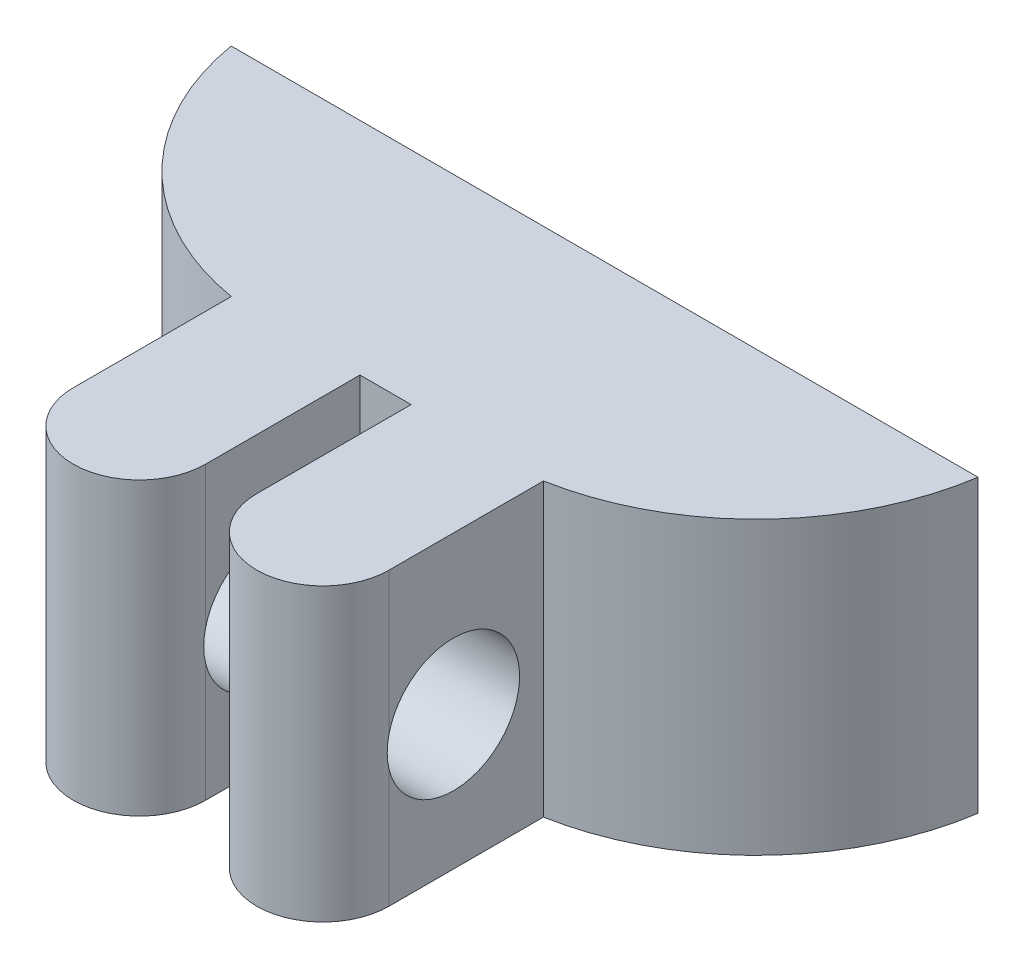
ISO-10303-21;
HEADER;
FILE_DESCRIPTION(('STEP AP214'),'2;1');
FILE_NAME('part.step','',(''),(''),'','','');
FILE_SCHEMA(('AUTOMOTIVE_DESIGN { 1 0 10303 214 1 1 1 1 }'));
ENDSEC;
DATA;
#1=APPLICATION_CONTEXT('core data for automotive mechanical design processes');
#2=APPLICATION_PROTOCOL_DEFINITION('international standard','automotive_design',2000,#1);
#3=PRODUCT_CONTEXT('',#1,'mechanical');
#4=PRODUCT('Part','Part','',(#3));
#5=PRODUCT_RELATED_PRODUCT_CATEGORY('part','',(#4));
#6=PRODUCT_DEFINITION_FORMATION('','',#4);
#7=PRODUCT_DEFINITION_CONTEXT('part definition',#1,'design');
#8=PRODUCT_DEFINITION('design','',#6,#7);
#9=PRODUCT_DEFINITION_SHAPE('','',#8);
#10=(LENGTH_UNIT() NAMED_UNIT(*) SI_UNIT(.MILLI.,.METRE.));
#11=(NAMED_UNIT(*) PLANE_ANGLE_UNIT() SI_UNIT($,.RADIAN.));
#12=(NAMED_UNIT(*) SI_UNIT($,.STERADIAN.) SOLID_ANGLE_UNIT());
#13=UNCERTAINTY_MEASURE_WITH_UNIT(LENGTH_MEASURE(1.E-05),#10,'distance_accuracy_value','');
#14=(GEOMETRIC_REPRESENTATION_CONTEXT(3) GLOBAL_UNCERTAINTY_ASSIGNED_CONTEXT((#13)) GLOBAL_UNIT_ASSIGNED_CONTEXT((#10,
#11,#12)) REPRESENTATION_CONTEXT('',''));
#15=CARTESIAN_POINT('',(0.,0.,0.));
#16=DIRECTION('',(0.,0.,1.));
#17=DIRECTION('',(1.,0.,0.));
#18=AXIS2_PLACEMENT_3D('',#15,#16,#17);
#19=CARTESIAN_POINT('',(-6.42,-15.,8.5));
#20=DIRECTION('',(0.,-1.,0.));
#21=DIRECTION('',(1.,0.,0.));
#22=AXIS2_PLACEMENT_3D('',#19,#20,#21);
#23=CYLINDRICAL_SURFACE('',#22,1.5);
#24=DIRECTION('',(0.,1.,0.));
#25=VECTOR('',#24,1.);
#26=CARTESIAN_POINT('',(-4.92,-15.,8.5));
#27=LINE('',#26,#25);
#28=CARTESIAN_POINT('',(-4.92,-4.2,8.5));
#29=VERTEX_POINT('',#28);
#30=CARTESIAN_POINT('',(-4.92,-7.41254560298488,8.5));
#31=VERTEX_POINT('',#30);
#32=EDGE_CURVE('E144',#29,#31,#27,.F.);
#33=ORIENTED_EDGE('',*,*,#32,.F.);
#34=CARTESIAN_POINT('',(-6.42,-4.2,8.5));
#35=DIRECTION('',(0.,1.,0.));
#36=DIRECTION('',(-1.,0.,0.));
#37=AXIS2_PLACEMENT_3D('',#34,#35,#36);
#38=CIRCLE('',#37,1.5);
#39=CARTESIAN_POINT('',(-7.92,-4.2,8.5));
#40=VERTEX_POINT('',#39);
#41=EDGE_CURVE('E288',#29,#40,#38,.F.);
#42=ORIENTED_EDGE('',*,*,#41,.T.);
#43=DIRECTION('',(0.,1.,0.));
#44=VECTOR('',#43,1.);
#45=CARTESIAN_POINT('',(-7.92,-15.,8.5));
#46=LINE('',#45,#44);
#47=CARTESIAN_POINT('',(-7.92,-7.41254560298488,8.5));
#48=VERTEX_POINT('',#47);
#49=EDGE_CURVE('E298',#48,#40,#46,.T.);
#50=ORIENTED_EDGE('',*,*,#49,.F.);
#51=CARTESIAN_POINT('',(-7.92,-8.11241498930769,8.5));
#52=CARTESIAN_POINT('',(-7.91998628453172,-8.07083334811054,8.50998083315785));
#53=CARTESIAN_POINT('',(-7.9198997939109,-8.02882317453306,8.51817415680516));
#54=CARTESIAN_POINT('',(-7.9196980439738,-7.94426039926696,8.53094623275822));
#55=CARTESIAN_POINT('',(-7.91958278702659,-7.90170784252037,8.53552528259058));
#56=CARTESIAN_POINT('',(-7.91944221228178,-7.8175456013426,8.54095494207867));
#57=CARTESIAN_POINT('',(-7.91941450011267,-7.77594230593276,8.54190496227109));
#58=CARTESIAN_POINT('',(-7.91945773722137,-7.69280182758984,8.54034650872186));
#59=CARTESIAN_POINT('',(-7.9195286830846,-7.65126464241848,8.53783815467585));
#60=CARTESIAN_POINT('',(-7.91971818120842,-7.56854053373394,8.52937975231243));
#61=CARTESIAN_POINT('',(-7.91983673546718,-7.52735362499621,8.52342955953406));
#62=CARTESIAN_POINT('',(-7.91999726950474,-7.44561552081858,8.50812900417141));
#63=CARTESIAN_POINT('',(-7.92003924765131,-7.40506433894762,8.49877856911519));
#64=CARTESIAN_POINT('',(-7.91985832468956,-7.3237385228141,8.47642670475488));
#65=CARTESIAN_POINT('',(-7.91962786252755,-7.28299028546851,8.46332907491475));
#66=CARTESIAN_POINT('',(-7.9186046539607,-7.20275981332158,8.4337059956231));
#67=CARTESIAN_POINT('',(-7.91781181407187,-7.16327779014349,8.41717997659411));
#68=CARTESIAN_POINT('',(-7.91659534384041,-7.12458438472793,8.39899318441214));
#69=B_SPLINE_CURVE_WITH_KNOTS('',3,(#51,#52,#53,#54,#55,#56,#57,#58,#59,#60,#61,#62,#63,#64,#65,
#66,#67,#68),.UNSPECIFIED.,.F.,.F.,(4,2,2,2,2,2,2,2,4),(0.,0.128248812008016,0.25648706548665,
0.381186174696835,0.505880968132204,0.630580995641014,0.755283681131891,0.883530080847564,
1.01179780394237),.UNSPECIFIED.);
#70=CARTESIAN_POINT('',(-7.92,-8.11241498930769,8.5));
#71=VERTEX_POINT('',#70);
#72=EDGE_CURVE('E214',#71,#48,#69,.T.);
#73=ORIENTED_EDGE('',*,*,#72,.F.);
#74=DIRECTION('',(0.,1.,0.));
#75=VECTOR('',#74,1.);
#76=CARTESIAN_POINT('',(-7.92,-15.,8.5));
#77=LINE('',#76,#75);
#78=CARTESIAN_POINT('',(-7.92,-10.8,8.5));
#79=VERTEX_POINT('',#78);
#80=EDGE_CURVE('E215',#79,#71,#77,.T.);
#81=ORIENTED_EDGE('',*,*,#80,.F.);
#82=CARTESIAN_POINT('',(-6.42,-10.8,8.5));
#83=DIRECTION('',(0.,-1.,0.));
#84=DIRECTION('',(1.,0.,0.));
#85=AXIS2_PLACEMENT_3D('',#82,#83,#84);
#86=CIRCLE('',#85,1.5);
#87=CARTESIAN_POINT('',(-4.92,-10.8,8.5));
#88=VERTEX_POINT('',#87);
#89=EDGE_CURVE('E268',#79,#88,#86,.F.);
#90=ORIENTED_EDGE('',*,*,#89,.T.);
#91=DIRECTION('',(0.,1.,0.));
#92=VECTOR('',#91,1.);
#93=CARTESIAN_POINT('',(-4.92,-15.,8.5));
#94=LINE('',#93,#92);
#95=CARTESIAN_POINT('',(-4.92,-8.11241498930769,8.5));
#96=VERTEX_POINT('',#95);
#97=EDGE_CURVE('E222',#96,#88,#94,.F.);
#98=ORIENTED_EDGE('',*,*,#97,.F.);
#99=CARTESIAN_POINT('',(-4.92,-7.41254560298488,8.5));
#100=CARTESIAN_POINT('',(-4.92001371546828,-7.45412724418204,8.50998083315785));
#101=CARTESIAN_POINT('',(-4.9201002060891,-7.49613741775952,8.51817415680516));
#102=CARTESIAN_POINT('',(-4.9203019560262,-7.58070019302562,8.53094623275822));
#103=CARTESIAN_POINT('',(-4.92041721297341,-7.6232527497722,8.53552528259058));
#104=CARTESIAN_POINT('',(-4.92055778771822,-7.70741499094998,8.54095494207867));
#105=CARTESIAN_POINT('',(-4.92058549988733,-7.74901828635982,8.54190496227109));
#106=CARTESIAN_POINT('',(-4.92054226277862,-7.83215876470274,8.54034650872186));
#107=CARTESIAN_POINT('',(-4.9204713169154,-7.8736959498741,8.53783815467585));
#108=CARTESIAN_POINT('',(-4.92028181879158,-7.95642005855864,8.52937975231243));
#109=CARTESIAN_POINT('',(-4.92016326453282,-7.99760696729637,8.52342955953406));
#110=CARTESIAN_POINT('',(-4.92000273049526,-8.07934507147401,8.50812900417141));
#111=CARTESIAN_POINT('',(-4.91996075234869,-8.11989625334496,8.49877856911518));
#112=CARTESIAN_POINT('',(-4.92014167531044,-8.20122206947848,8.47642670475488));
#113=CARTESIAN_POINT('',(-4.92037213747244,-8.24197030682407,8.46332907491474));
#114=CARTESIAN_POINT('',(-4.9213953460393,-8.322200778971,8.43370599562309));
#115=CARTESIAN_POINT('',(-4.92218818592813,-8.36168280214909,8.4171799765941));
#116=CARTESIAN_POINT('',(-4.92340465615959,-8.40037620756465,8.39899318441214));
#117=B_SPLINE_CURVE_WITH_KNOTS('',3,(#99,#100,#101,#102,#103,#104,#105,#106,#107,#108,#109,#110,
#111,#112,#113,#114,#115,#116),.UNSPECIFIED.,.F.,.F.,(4,2,2,2,2,2,2,2,4),(0.,0.128248812008016,
0.256487065486652,0.381186174696836,0.505880968132207,0.630580995641019,0.755283681131896,
0.883530080847569,1.01179780394237),.UNSPECIFIED.);
#118=EDGE_CURVE('E207',#31,#96,#117,.T.);
#119=ORIENTED_EDGE('',*,*,#118,.F.);
#120=EDGE_LOOP('',(#33,#42,#50,#73,#81,#90,#98,#119));
#121=FACE_BOUND('',#120,.T.);
#122=ADVANCED_FACE('F38',(#121),#23,.T.);
#123=CARTESIAN_POINT('',(-10.58,-15.,8.5));
#124=DIRECTION('',(0.,-1.,0.));
#125=DIRECTION('',(1.,0.,0.));
#126=AXIS2_PLACEMENT_3D('',#123,#124,#125);
#127=CYLINDRICAL_SURFACE('',#126,1.5);
#128=DIRECTION('',(0.,1.,0.));
#129=VECTOR('',#128,1.);
#130=CARTESIAN_POINT('',(-9.08,-15.,8.5));
#131=LINE('',#130,#129);
#132=CARTESIAN_POINT('',(-9.08,-4.2,8.5));
#133=VERTEX_POINT('',#132);
#134=CARTESIAN_POINT('',(-9.08,-7.41254560298488,8.5));
#135=VERTEX_POINT('',#134);
#136=EDGE_CURVE('E299',#133,#135,#131,.F.);
#137=ORIENTED_EDGE('',*,*,#136,.F.);
#138=CARTESIAN_POINT('',(-10.58,-4.2,8.5));
#139=DIRECTION('',(0.,1.,0.));
#140=DIRECTION('',(-1.,0.,0.));
#141=AXIS2_PLACEMENT_3D('',#138,#139,#140);
#142=CIRCLE('',#141,1.5);
#143=CARTESIAN_POINT('',(-12.08,-4.2,8.5));
#144=VERTEX_POINT('',#143);
#145=EDGE_CURVE('E281',#133,#144,#142,.F.);
#146=ORIENTED_EDGE('',*,*,#145,.T.);
#147=DIRECTION('',(0.,1.,0.));
#148=VECTOR('',#147,1.);
#149=CARTESIAN_POINT('',(-12.08,-15.,8.5));
#150=LINE('',#149,#148);
#151=CARTESIAN_POINT('',(-12.08,-7.41254560298488,8.5));
#152=VERTEX_POINT('',#151);
#153=EDGE_CURVE('E169',#152,#144,#150,.T.);
#154=ORIENTED_EDGE('',*,*,#153,.F.);
#155=CARTESIAN_POINT('',(-12.08,-8.11241498930769,8.5));
#156=CARTESIAN_POINT('',(-12.0799862845317,-8.07083334811054,8.50998083315785));
#157=CARTESIAN_POINT('',(-12.0798997939109,-8.02882317453306,8.51817415680516));
#158=CARTESIAN_POINT('',(-12.0796980439738,-7.94426039926696,8.53094623275822));
#159=CARTESIAN_POINT('',(-12.0795827870266,-7.90170784252037,8.53552528259058));
#160=CARTESIAN_POINT('',(-12.0794422122818,-7.8175456013426,8.54095494207867));
#161=CARTESIAN_POINT('',(-12.0794145001127,-7.77594230593276,8.54190496227109));
#162=CARTESIAN_POINT('',(-12.0794577372214,-7.69280182758984,8.54034650872186));
#163=CARTESIAN_POINT('',(-12.0795286830846,-7.65126464241848,8.53783815467585));
#164=CARTESIAN_POINT('',(-12.0797181812084,-7.56854053373394,8.52937975231243));
#165=CARTESIAN_POINT('',(-12.0798367354672,-7.52735362499621,8.52342955953406));
#166=CARTESIAN_POINT('',(-12.0799972695047,-7.44561552081858,8.50812900417141));
#167=CARTESIAN_POINT('',(-12.0800392476513,-7.40506433894762,8.49877856911519));
#168=CARTESIAN_POINT('',(-12.0798583246896,-7.3237385228141,8.47642670475488));
#169=CARTESIAN_POINT('',(-12.0796278625276,-7.28299028546851,8.46332907491475));
#170=CARTESIAN_POINT('',(-12.0786046539607,-7.20275981332158,8.4337059956231));
#171=CARTESIAN_POINT('',(-12.0778118140719,-7.16327779014349,8.41717997659411));
#172=CARTESIAN_POINT('',(-12.0765953438404,-7.12458438472793,8.39899318441214));
#173=B_SPLINE_CURVE_WITH_KNOTS('',3,(#155,#156,#157,#158,#159,#160,#161,#162,#163,#164,#165,
#166,#167,#168,#169,#170,#171,#172),.UNSPECIFIED.,.F.,.F.,(4,2,2,2,2,2,2,2,4),(0.,
0.128248812008016,0.25648706548665,0.381186174696835,0.505880968132204,0.630580995641014,
0.755283681131891,0.883530080847564,1.01179780394237),.UNSPECIFIED.);
#174=CARTESIAN_POINT('',(-12.08,-8.11241498930769,8.5));
#175=VERTEX_POINT('',#174);
#176=EDGE_CURVE('E182',#175,#152,#173,.T.);
#177=ORIENTED_EDGE('',*,*,#176,.F.);
#178=DIRECTION('',(0.,1.,0.));
#179=VECTOR('',#178,1.);
#180=CARTESIAN_POINT('',(-12.08,-15.,8.5));
#181=LINE('',#180,#179);
#182=CARTESIAN_POINT('',(-12.08,-10.8,8.5));
#183=VERTEX_POINT('',#182);
#184=EDGE_CURVE('E172',#183,#175,#181,.T.);
#185=ORIENTED_EDGE('',*,*,#184,.F.);
#186=CARTESIAN_POINT('',(-10.58,-10.8,8.5));
#187=DIRECTION('',(0.,-1.,0.));
#188=DIRECTION('',(1.,0.,0.));
#189=AXIS2_PLACEMENT_3D('',#186,#187,#188);
#190=CIRCLE('',#189,1.5);
#191=CARTESIAN_POINT('',(-9.08,-10.8,8.5));
#192=VERTEX_POINT('',#191);
#193=EDGE_CURVE('E270',#183,#192,#190,.F.);
#194=ORIENTED_EDGE('',*,*,#193,.T.);
#195=DIRECTION('',(0.,1.,0.));
#196=VECTOR('',#195,1.);
#197=CARTESIAN_POINT('',(-9.08,-15.,8.5));
#198=LINE('',#197,#196);
#199=CARTESIAN_POINT('',(-9.08,-8.11241498930769,8.5));
#200=VERTEX_POINT('',#199);
#201=EDGE_CURVE('E300',#200,#192,#198,.F.);
#202=ORIENTED_EDGE('',*,*,#201,.F.);
#203=CARTESIAN_POINT('',(-9.08,-7.41254560298488,8.5));
#204=CARTESIAN_POINT('',(-9.08001371546828,-7.45412724418204,8.50998083315785));
#205=CARTESIAN_POINT('',(-9.0801002060891,-7.49613741775952,8.51817415680516));
#206=CARTESIAN_POINT('',(-9.0803019560262,-7.58070019302562,8.53094623275822));
#207=CARTESIAN_POINT('',(-9.08041721297341,-7.6232527497722,8.53552528259058));
#208=CARTESIAN_POINT('',(-9.08055778771822,-7.70741499094998,8.54095494207867));
#209=CARTESIAN_POINT('',(-9.08058549988733,-7.74901828635982,8.54190496227109));
#210=CARTESIAN_POINT('',(-9.08054226277862,-7.83215876470274,8.54034650872186));
#211=CARTESIAN_POINT('',(-9.0804713169154,-7.8736959498741,8.53783815467585));
#212=CARTESIAN_POINT('',(-9.08028181879158,-7.95642005855864,8.52937975231243));
#213=CARTESIAN_POINT('',(-9.08016326453282,-7.99760696729637,8.52342955953406));
#214=CARTESIAN_POINT('',(-9.08000273049526,-8.07934507147401,8.50812900417141));
#215=CARTESIAN_POINT('',(-9.07996075234869,-8.11989625334496,8.49877856911518));
#216=CARTESIAN_POINT('',(-9.08014167531044,-8.20122206947848,8.47642670475488));
#217=CARTESIAN_POINT('',(-9.08037213747244,-8.24197030682407,8.46332907491474));
#218=CARTESIAN_POINT('',(-9.0813953460393,-8.322200778971,8.43370599562309));
#219=CARTESIAN_POINT('',(-9.08218818592813,-8.36168280214909,8.4171799765941));
#220=CARTESIAN_POINT('',(-9.08340465615959,-8.40037620756465,8.39899318441214));
#221=B_SPLINE_CURVE_WITH_KNOTS('',3,(#203,#204,#205,#206,#207,#208,#209,#210,#211,#212,#213,
#214,#215,#216,#217,#218,#219,#220),.UNSPECIFIED.,.F.,.F.,(4,2,2,2,2,2,2,2,4),(0.,
0.128248812008016,0.256487065486652,0.381186174696836,0.505880968132207,0.630580995641019,
0.755283681131896,0.883530080847569,1.01179780394237),.UNSPECIFIED.);
#222=EDGE_CURVE('E174',#135,#200,#221,.T.);
#223=ORIENTED_EDGE('',*,*,#222,.F.);
#224=EDGE_LOOP('',(#137,#146,#154,#177,#185,#194,#202,#223));
#225=FACE_BOUND('',#224,.T.);
#226=ADVANCED_FACE('F189',(#225),#127,.T.);
#227=CARTESIAN_POINT('',(0.,0.,5.));
#228=DIRECTION('',(0.,0.,-1.));
#229=DIRECTION('',(-1.,0.,0.));
#230=AXIS2_PLACEMENT_3D('',#227,#228,#229);
#231=PLANE('',#230);
#232=DIRECTION('',(1.,0.,0.));
#233=VECTOR('',#232,1.);
#234=CARTESIAN_POINT('',(0.,-4.2,5.));
#235=LINE('',#234,#233);
#236=CARTESIAN_POINT('',(-9.08,-4.2,5.));
#237=VERTEX_POINT('',#236);
#238=CARTESIAN_POINT('',(-7.92,-4.2,5.));
#239=VERTEX_POINT('',#238);
#240=EDGE_CURVE('E263',#237,#239,#235,.T.);
#241=ORIENTED_EDGE('',*,*,#240,.F.);
#242=DIRECTION('',(0.,1.,0.));
#243=VECTOR('',#242,1.);
#244=CARTESIAN_POINT('',(-9.08,-0.0236385703848998,5.));
#245=LINE('',#244,#243);
#246=CARTESIAN_POINT('',(-9.08,-10.8,5.));
#247=VERTEX_POINT('',#246);
#248=EDGE_CURVE('E241',#247,#237,#245,.T.);
#249=ORIENTED_EDGE('',*,*,#248,.F.);
#250=DIRECTION('',(-1.,0.,0.));
#251=VECTOR('',#250,1.);
#252=CARTESIAN_POINT('',(0.,-10.8,5.));
#253=LINE('',#252,#251);
#254=CARTESIAN_POINT('',(-7.92,-10.8,5.));
#255=VERTEX_POINT('',#254);
#256=EDGE_CURVE('E264',#255,#247,#253,.T.);
#257=ORIENTED_EDGE('',*,*,#256,.F.);
#258=DIRECTION('',(0.,-1.,0.));
#259=VECTOR('',#258,1.);
#260=CARTESIAN_POINT('',(-7.92,0.,5.));
#261=LINE('',#260,#259);
#262=EDGE_CURVE('E159',#239,#255,#261,.T.);
#263=ORIENTED_EDGE('',*,*,#262,.F.);
#264=EDGE_LOOP('',(#241,#249,#257,#263));
#265=FACE_BOUND('',#264,.T.);
#266=ADVANCED_FACE('F261',(#265),#231,.F.);
#267=CARTESIAN_POINT('',(0.,0.,0.));
#268=DIRECTION('',(0.,0.,-1.));
#269=DIRECTION('',(-1.,0.,0.));
#270=AXIS2_PLACEMENT_3D('',#267,#268,#269);
#271=PLANE('',#270);
#272=DIRECTION('',(0.,-1.,0.));
#273=VECTOR('',#272,1.);
#274=CARTESIAN_POINT('',(-17.,0.,0.));
#275=LINE('',#274,#273);
#276=CARTESIAN_POINT('',(-17.,-4.2,0.));
#277=VERTEX_POINT('',#276);
#278=CARTESIAN_POINT('',(-17.,-10.8,0.));
#279=VERTEX_POINT('',#278);
#280=EDGE_CURVE('E149',#277,#279,#275,.T.);
#281=ORIENTED_EDGE('',*,*,#280,.F.);
#282=DIRECTION('',(1.,0.,0.));
#283=VECTOR('',#282,1.);
#284=CARTESIAN_POINT('',(0.,-4.2,0.));
#285=LINE('',#284,#283);
#286=CARTESIAN_POINT('',(-0.068187746454032,-4.2,0.));
#287=VERTEX_POINT('',#286);
#288=EDGE_CURVE('E62',#277,#287,#285,.T.);
#289=ORIENTED_EDGE('',*,*,#288,.T.);
#290=DIRECTION('',(0.,1.,0.));
#291=VECTOR('',#290,1.);
#292=CARTESIAN_POINT('',(-0.0681877464540313,-7.5,0.));
#293=LINE('',#292,#291);
#294=CARTESIAN_POINT('',(-0.0681877464540305,-10.8,0.));
#295=VERTEX_POINT('',#294);
#296=EDGE_CURVE('E151',#287,#295,#293,.F.);
#297=ORIENTED_EDGE('',*,*,#296,.T.);
#298=DIRECTION('',(-1.,0.,0.));
#299=VECTOR('',#298,1.);
#300=CARTESIAN_POINT('',(-0.0681877464540305,-10.8,0.));
#301=LINE('',#300,#299);
#302=EDGE_CURVE('E138',#295,#279,#301,.T.);
#303=ORIENTED_EDGE('',*,*,#302,.T.);
#304=EDGE_LOOP('',(#281,#289,#297,#303));
#305=FACE_BOUND('',#304,.T.);
#306=ADVANCED_FACE('F148',(#305),#271,.T.);
#307=CARTESIAN_POINT('',(-7.92,0.,10.));
#308=DIRECTION('',(1.,0.,0.));
#309=DIRECTION('',(0.,1.,0.));
#310=AXIS2_PLACEMENT_3D('',#307,#308,#309);
#311=PLANE('',#310);
#312=DIRECTION('',(0.,0.,1.));
#313=VECTOR('',#312,1.);
#314=CARTESIAN_POINT('',(-7.92,-4.2,10.));
#315=LINE('',#314,#313);
#316=EDGE_CURVE('E257',#239,#40,#315,.T.);
#317=ORIENTED_EDGE('',*,*,#316,.F.);
#318=ORIENTED_EDGE('',*,*,#262,.T.);
#319=DIRECTION('',(0.,0.,-1.));
#320=VECTOR('',#319,1.);
#321=CARTESIAN_POINT('',(-7.92,-10.8,10.));
#322=LINE('',#321,#320);
#323=EDGE_CURVE('E254',#79,#255,#322,.T.);
#324=ORIENTED_EDGE('',*,*,#323,.F.);
#325=ORIENTED_EDGE('',*,*,#80,.T.);
#326=CARTESIAN_POINT('',(-7.92,-7.76248029614629,7.04138911613754));
#327=DIRECTION('',(1.,0.,0.));
#328=DIRECTION('',(0.,1.,0.));
#329=AXIS2_PLACEMENT_3D('',#326,#327,#328);
#330=CIRCLE('',#329,1.5);
#331=EDGE_CURVE('E238',#71,#48,#330,.T.);
#332=ORIENTED_EDGE('',*,*,#331,.T.);
#333=ORIENTED_EDGE('',*,*,#49,.T.);
#334=EDGE_LOOP('',(#317,#318,#324,#325,#332,#333));
#335=FACE_BOUND('',#334,.T.);
#336=ADVANCED_FACE('F253',(#335),#311,.F.);
#337=CARTESIAN_POINT('',(-4.92,0.,10.));
#338=DIRECTION('',(-1.,0.,0.));
#339=DIRECTION('',(0.,-1.,0.));
#340=AXIS2_PLACEMENT_3D('',#337,#338,#339);
#341=PLANE('',#340);
#342=DIRECTION('',(0.,0.,-1.));
#343=VECTOR('',#342,1.);
#344=CARTESIAN_POINT('',(-4.92,-4.2,10.));
#345=LINE('',#344,#343);
#346=CARTESIAN_POINT('',(-4.92,-4.2,5.));
#347=VERTEX_POINT('',#346);
#348=EDGE_CURVE('E233',#29,#347,#345,.T.);
#349=ORIENTED_EDGE('',*,*,#348,.F.);
#350=ORIENTED_EDGE('',*,*,#32,.T.);
#351=CARTESIAN_POINT('',(-4.92,-7.76248029614629,7.04138911613754));
#352=DIRECTION('',(-1.,0.,0.));
#353=DIRECTION('',(0.,-1.,0.));
#354=AXIS2_PLACEMENT_3D('',#351,#352,#353);
#355=CIRCLE('',#354,1.5);
#356=EDGE_CURVE('E232',#31,#96,#355,.T.);
#357=ORIENTED_EDGE('',*,*,#356,.T.);
#358=ORIENTED_EDGE('',*,*,#97,.T.);
#359=DIRECTION('',(0.,0.,1.));
#360=VECTOR('',#359,1.);
#361=CARTESIAN_POINT('',(-4.92,-10.8,10.));
#362=LINE('',#361,#360);
#363=CARTESIAN_POINT('',(-4.92,-10.8,5.));
#364=VERTEX_POINT('',#363);
#365=EDGE_CURVE('E275',#364,#88,#362,.T.);
#366=ORIENTED_EDGE('',*,*,#365,.F.);
#367=DIRECTION('',(0.,1.,0.));
#368=VECTOR('',#367,1.);
#369=CARTESIAN_POINT('',(-4.92,0.,5.));
#370=LINE('',#369,#368);
#371=EDGE_CURVE('E154',#364,#347,#370,.T.);
#372=ORIENTED_EDGE('',*,*,#371,.T.);
#373=EDGE_LOOP('',(#349,#350,#357,#358,#366,#372));
#374=FACE_BOUND('',#373,.T.);
#375=ADVANCED_FACE('F230',(#374),#341,.F.);
#376=CARTESIAN_POINT('',(-12.08,-0.0236385703848998,10.));
#377=DIRECTION('',(1.,0.,0.));
#378=DIRECTION('',(0.,1.,0.));
#379=AXIS2_PLACEMENT_3D('',#376,#377,#378);
#380=PLANE('',#379);
#381=DIRECTION('',(0.,0.,1.));
#382=VECTOR('',#381,1.);
#383=CARTESIAN_POINT('',(-12.08,-4.2,10.));
#384=LINE('',#383,#382);
#385=CARTESIAN_POINT('',(-12.08,-4.2,4.91674108489633));
#386=VERTEX_POINT('',#385);
#387=EDGE_CURVE('E279',#386,#144,#384,.T.);
#388=ORIENTED_EDGE('',*,*,#387,.F.);
#389=DIRECTION('',(0.,1.,0.));
#390=VECTOR('',#389,1.);
#391=CARTESIAN_POINT('',(-12.08,-0.0236385703848998,4.91674108489633));
#392=LINE('',#391,#390);
#393=CARTESIAN_POINT('',(-12.08,-10.8,4.91674108489633));
#394=VERTEX_POINT('',#393);
#395=EDGE_CURVE('E156',#386,#394,#392,.F.);
#396=ORIENTED_EDGE('',*,*,#395,.T.);
#397=DIRECTION('',(0.,0.,-1.));
#398=VECTOR('',#397,1.);
#399=CARTESIAN_POINT('',(-12.08,-10.8,10.));
#400=LINE('',#399,#398);
#401=EDGE_CURVE('E54',#183,#394,#400,.T.);
#402=ORIENTED_EDGE('',*,*,#401,.F.);
#403=ORIENTED_EDGE('',*,*,#184,.T.);
#404=CARTESIAN_POINT('',(-12.08,-7.76248029614629,7.04138911613754));
#405=DIRECTION('',(1.,0.,0.));
#406=DIRECTION('',(0.,1.,0.));
#407=AXIS2_PLACEMENT_3D('',#404,#405,#406);
#408=CIRCLE('',#407,1.5);
#409=EDGE_CURVE('E165',#175,#152,#408,.T.);
#410=ORIENTED_EDGE('',*,*,#409,.T.);
#411=ORIENTED_EDGE('',*,*,#153,.T.);
#412=EDGE_LOOP('',(#388,#396,#402,#403,#410,#411));
#413=FACE_BOUND('',#412,.T.);
#414=ADVANCED_FACE('F200',(#413),#380,.F.);
#415=CARTESIAN_POINT('',(-9.08,-0.0236385703848998,10.));
#416=DIRECTION('',(-1.,0.,0.));
#417=DIRECTION('',(0.,-1.,0.));
#418=AXIS2_PLACEMENT_3D('',#415,#416,#417);
#419=PLANE('',#418);
#420=DIRECTION('',(0.,0.,-1.));
#421=VECTOR('',#420,1.);
#422=CARTESIAN_POINT('',(-9.08,-4.2,10.));
#423=LINE('',#422,#421);
#424=EDGE_CURVE('E284',#133,#237,#423,.T.);
#425=ORIENTED_EDGE('',*,*,#424,.F.);
#426=ORIENTED_EDGE('',*,*,#136,.T.);
#427=CARTESIAN_POINT('',(-9.08,-7.76248029614629,7.04138911613754));
#428=DIRECTION('',(-1.,0.,0.));
#429=DIRECTION('',(0.,-1.,0.));
#430=AXIS2_PLACEMENT_3D('',#427,#428,#429);
#431=CIRCLE('',#430,1.5);
#432=EDGE_CURVE('E163',#135,#200,#431,.T.);
#433=ORIENTED_EDGE('',*,*,#432,.T.);
#434=ORIENTED_EDGE('',*,*,#201,.T.);
#435=DIRECTION('',(0.,0.,1.));
#436=VECTOR('',#435,1.);
#437=CARTESIAN_POINT('',(-9.08,-10.8,10.));
#438=LINE('',#437,#436);
#439=EDGE_CURVE('E266',#247,#192,#438,.T.);
#440=ORIENTED_EDGE('',*,*,#439,.F.);
#441=ORIENTED_EDGE('',*,*,#248,.T.);
#442=EDGE_LOOP('',(#425,#426,#433,#434,#440,#441));
#443=FACE_BOUND('',#442,.T.);
#444=ADVANCED_FACE('F318',(#443),#419,.F.);
#445=CARTESIAN_POINT('',(-6.,0.,-0.90199966113181));
#446=DIRECTION('',(0.,1.,0.));
#447=DIRECTION('',(-1.,0.,0.));
#448=AXIS2_PLACEMENT_3D('',#445,#446,#447);
#449=CYLINDRICAL_SURFACE('',#448,6.);
#450=ORIENTED_EDGE('',*,*,#296,.F.);
#451=CARTESIAN_POINT('',(-6.,-4.2,-0.90199966113181));
#452=DIRECTION('',(0.,1.,0.));
#453=DIRECTION('',(-1.,0.,0.));
#454=AXIS2_PLACEMENT_3D('',#451,#452,#453);
#455=CIRCLE('',#454,6.);
#456=EDGE_CURVE('E166',#287,#347,#455,.F.);
#457=ORIENTED_EDGE('',*,*,#456,.T.);
#458=ORIENTED_EDGE('',*,*,#371,.F.);
#459=CARTESIAN_POINT('',(-6.,-10.8,-0.90199966113181));
#460=DIRECTION('',(0.,-1.,0.));
#461=DIRECTION('',(1.,0.,0.));
#462=AXIS2_PLACEMENT_3D('',#459,#460,#461);
#463=CIRCLE('',#462,6.);
#464=EDGE_CURVE('E277',#364,#295,#463,.F.);
#465=ORIENTED_EDGE('',*,*,#464,.T.);
#466=EDGE_LOOP('',(#450,#457,#458,#465));
#467=FACE_BOUND('',#466,.T.);
#468=ADVANCED_FACE('F293',(#467),#449,.T.);
#469=CARTESIAN_POINT('',(-11.0839202169004,0.,-1.));
#470=DIRECTION('',(0.,1.,0.));
#471=DIRECTION('',(0.,0.,1.));
#472=AXIS2_PLACEMENT_3D('',#469,#470,#471);
#473=CYLINDRICAL_SURFACE('',#472,6.);
#474=ORIENTED_EDGE('',*,*,#395,.F.);
#475=CARTESIAN_POINT('',(-11.0839202169004,-4.2,-1.));
#476=DIRECTION('',(0.,1.,0.));
#477=DIRECTION('',(-1.,0.,0.));
#478=AXIS2_PLACEMENT_3D('',#475,#476,#477);
#479=CIRCLE('',#478,6.);
#480=EDGE_CURVE('E11',#386,#277,#479,.F.);
#481=ORIENTED_EDGE('',*,*,#480,.T.);
#482=ORIENTED_EDGE('',*,*,#280,.T.);
#483=CARTESIAN_POINT('',(-11.0839202169004,-10.8,-1.));
#484=DIRECTION('',(0.,-1.,0.));
#485=DIRECTION('',(1.,0.,0.));
#486=AXIS2_PLACEMENT_3D('',#483,#484,#485);
#487=CIRCLE('',#486,6.);
#488=EDGE_CURVE('E47',#279,#394,#487,.F.);
#489=ORIENTED_EDGE('',*,*,#488,.T.);
#490=EDGE_LOOP('',(#474,#481,#482,#489));
#491=FACE_BOUND('',#490,.T.);
#492=ADVANCED_FACE('F153',(#491),#473,.T.);
#493=CARTESIAN_POINT('',(-17.,-7.76248029614629,7.04138911613754));
#494=DIRECTION('',(1.,0.,0.));
#495=DIRECTION('',(0.,0.,-1.));
#496=AXIS2_PLACEMENT_3D('',#493,#494,#495);
#497=CYLINDRICAL_SURFACE('',#496,1.5);
#498=ORIENTED_EDGE('',*,*,#432,.F.);
#499=ORIENTED_EDGE('',*,*,#222,.T.);
#500=EDGE_LOOP('',(#498,#499));
#501=FACE_BOUND('',#500,.T.);
#502=ORIENTED_EDGE('',*,*,#409,.F.);
#503=ORIENTED_EDGE('',*,*,#176,.T.);
#504=EDGE_LOOP('',(#502,#503));
#505=FACE_BOUND('',#504,.T.);
#506=ADVANCED_FACE('F197',(#501,#505),#497,.F.);
#507=ORIENTED_EDGE('',*,*,#356,.F.);
#508=ORIENTED_EDGE('',*,*,#118,.T.);
#509=EDGE_LOOP('',(#507,#508));
#510=FACE_BOUND('',#509,.T.);
#511=ORIENTED_EDGE('',*,*,#331,.F.);
#512=ORIENTED_EDGE('',*,*,#72,.T.);
#513=EDGE_LOOP('',(#511,#512));
#514=FACE_BOUND('',#513,.T.);
#515=ADVANCED_FACE('F192',(#510,#514),#497,.F.);
#516=CARTESIAN_POINT('',(-0.0681877464540305,-10.8,14.));
#517=DIRECTION('',(0.,-1.,0.));
#518=DIRECTION('',(1.,0.,0.));
#519=AXIS2_PLACEMENT_3D('',#516,#517,#518);
#520=PLANE('',#519);
#521=ORIENTED_EDGE('',*,*,#365,.T.);
#522=ORIENTED_EDGE('',*,*,#89,.F.);
#523=ORIENTED_EDGE('',*,*,#323,.T.);
#524=ORIENTED_EDGE('',*,*,#256,.T.);
#525=ORIENTED_EDGE('',*,*,#439,.T.);
#526=ORIENTED_EDGE('',*,*,#193,.F.);
#527=ORIENTED_EDGE('',*,*,#401,.T.);
#528=ORIENTED_EDGE('',*,*,#488,.F.);
#529=ORIENTED_EDGE('',*,*,#302,.F.);
#530=ORIENTED_EDGE('',*,*,#464,.F.);
#531=EDGE_LOOP('',(#521,#522,#523,#524,#525,#526,#527,#528,#529,#530));
#532=FACE_BOUND('',#531,.T.);
#533=ADVANCED_FACE('F137',(#532),#520,.T.);
#534=CARTESIAN_POINT('',(0.,-4.2,14.));
#535=DIRECTION('',(0.,1.,0.));
#536=DIRECTION('',(-1.,0.,0.));
#537=AXIS2_PLACEMENT_3D('',#534,#535,#536);
#538=PLANE('',#537);
#539=ORIENTED_EDGE('',*,*,#288,.F.);
#540=ORIENTED_EDGE('',*,*,#480,.F.);
#541=ORIENTED_EDGE('',*,*,#387,.T.);
#542=ORIENTED_EDGE('',*,*,#145,.F.);
#543=ORIENTED_EDGE('',*,*,#424,.T.);
#544=ORIENTED_EDGE('',*,*,#240,.T.);
#545=ORIENTED_EDGE('',*,*,#316,.T.);
#546=ORIENTED_EDGE('',*,*,#41,.F.);
#547=ORIENTED_EDGE('',*,*,#348,.T.);
#548=ORIENTED_EDGE('',*,*,#456,.F.);
#549=EDGE_LOOP('',(#539,#540,#541,#542,#543,#544,#545,#546,#547,#548));
#550=FACE_BOUND('',#549,.T.);
#551=ADVANCED_FACE('F381',(#550),#538,.T.);
#552=CLOSED_SHELL('',(#122,#226,#266,#306,#336,#375,#414,#444,#468,#492,#506,#515,#533,#551));
#553=MANIFOLD_SOLID_BREP('B2',#552);
#554=ADVANCED_BREP_SHAPE_REPRESENTATION('',(#18,#553),#14);
#555=SHAPE_DEFINITION_REPRESENTATION(#9,#554);
ENDSEC;
END-ISO-10303-21;
